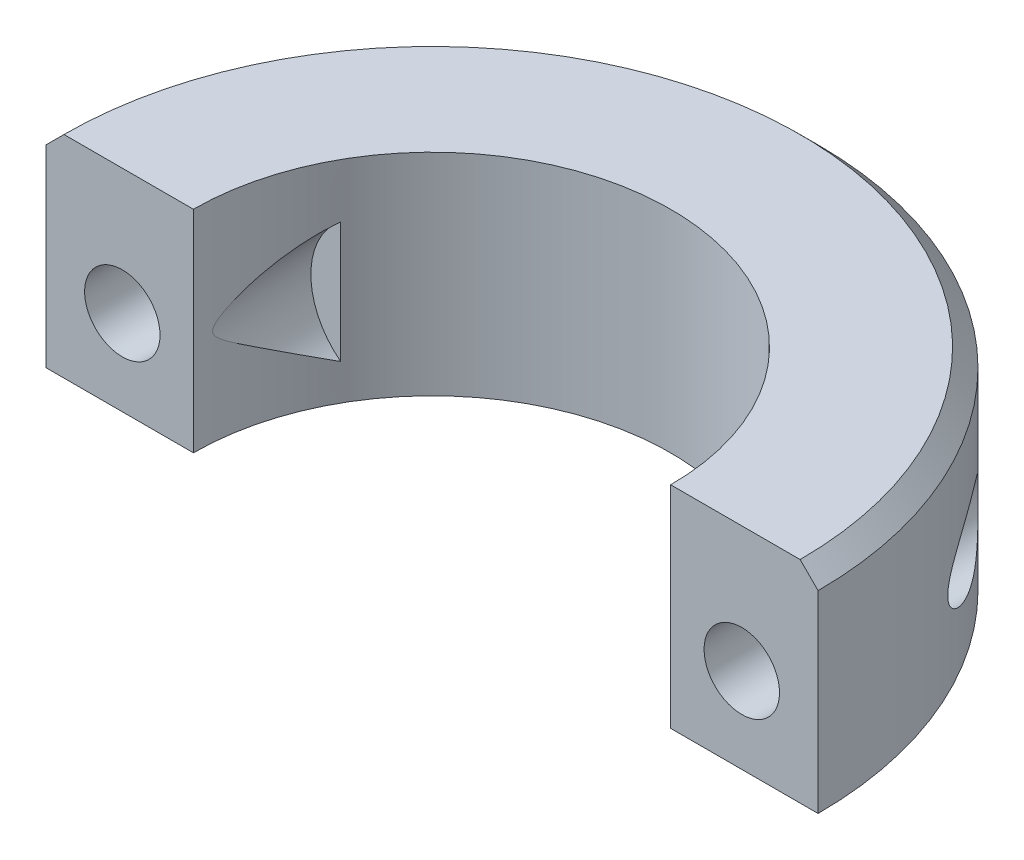
ISO-10303-21;
HEADER;
FILE_DESCRIPTION(('STEP AP214'),'2;1');
FILE_NAME('part.step','',(''),(''),'','','');
FILE_SCHEMA(('AUTOMOTIVE_DESIGN { 1 0 10303 214 1 1 1 1 }'));
ENDSEC;
DATA;
#1=APPLICATION_CONTEXT('core data for automotive mechanical design processes');
#2=APPLICATION_PROTOCOL_DEFINITION('international standard','automotive_design',2000,#1);
#3=PRODUCT_CONTEXT('',#1,'mechanical');
#4=PRODUCT('Part','Part','',(#3));
#5=PRODUCT_RELATED_PRODUCT_CATEGORY('part','',(#4));
#6=PRODUCT_DEFINITION_FORMATION('','',#4);
#7=PRODUCT_DEFINITION_CONTEXT('part definition',#1,'design');
#8=PRODUCT_DEFINITION('design','',#6,#7);
#9=PRODUCT_DEFINITION_SHAPE('','',#8);
#10=(LENGTH_UNIT() NAMED_UNIT(*) SI_UNIT(.MILLI.,.METRE.));
#11=(NAMED_UNIT(*) PLANE_ANGLE_UNIT() SI_UNIT($,.RADIAN.));
#12=(NAMED_UNIT(*) SI_UNIT($,.STERADIAN.) SOLID_ANGLE_UNIT());
#13=UNCERTAINTY_MEASURE_WITH_UNIT(LENGTH_MEASURE(1.E-05),#10,'distance_accuracy_value','');
#14=(GEOMETRIC_REPRESENTATION_CONTEXT(3) GLOBAL_UNCERTAINTY_ASSIGNED_CONTEXT((#13)) GLOBAL_UNIT_ASSIGNED_CONTEXT((#10,
#11,#12)) REPRESENTATION_CONTEXT('',''));
#15=CARTESIAN_POINT('',(0.,0.,0.));
#16=DIRECTION('',(0.,0.,1.));
#17=DIRECTION('',(1.,0.,0.));
#18=AXIS2_PLACEMENT_3D('',#15,#16,#17);
#19=CARTESIAN_POINT('',(0.,5.875,0.));
#20=DIRECTION('',(0.,-1.,0.));
#21=DIRECTION('',(0.,0.,-1.));
#22=AXIS2_PLACEMENT_3D('',#19,#20,#21);
#23=CYLINDRICAL_SURFACE('',#22,13.29);
#24=DIRECTION('',(0.,-1.,0.));
#25=VECTOR('',#24,1.);
#26=CARTESIAN_POINT('',(11.5919842995063,5.875,-6.5));
#27=LINE('',#26,#25);
#28=CARTESIAN_POINT('',(11.5919842995063,-3.86810293653756,-6.5));
#29=VERTEX_POINT('',#28);
#30=CARTESIAN_POINT('',(11.5919842995063,2.86810293653756,-6.5));
#31=VERTEX_POINT('',#30);
#32=EDGE_CURVE('E45',#29,#31,#27,.F.);
#33=ORIENTED_EDGE('',*,*,#32,.T.);
#34=CARTESIAN_POINT('',(11.5919842995063,2.86810293653756,-6.5));
#35=CARTESIAN_POINT('',(11.674683553741,2.80444816907887,-6.35251308565447));
#36=CARTESIAN_POINT('',(11.7541320407431,2.73846936503557,-6.20423050295897));
#37=CARTESIAN_POINT('',(11.9066140690534,2.60234710274309,-5.90632247899956));
#38=CARTESIAN_POINT('',(11.9796488049704,2.53220442414301,-5.75669729355206));
#39=CARTESIAN_POINT('',(12.1194056480824,2.38822924076577,-5.45632970509054));
#40=CARTESIAN_POINT('',(12.1861291129961,2.31439753484135,-5.30558754992459));
#41=CARTESIAN_POINT('',(12.3133814671471,2.1634087979424,-5.00316510668472));
#42=CARTESIAN_POINT('',(12.3739100706451,2.08625161381254,-4.85148477567911));
#43=CARTESIAN_POINT('',(12.545732212589,1.85114484089873,-4.3969544518868));
#44=CARTESIAN_POINT('',(12.6480399030139,1.68874820151547,-4.09293363102073));
#45=CARTESIAN_POINT('',(12.7838946017017,1.43744373143042,-3.636122948353));
#46=CARTESIAN_POINT('',(12.8262430339326,1.35239594178326,-3.48373189564499));
#47=CARTESIAN_POINT('',(12.9051597349178,1.17965887621674,-3.17894861259805));
#48=CARTESIAN_POINT('',(12.9417284761305,1.09196981690528,-3.02655638337478));
#49=CARTESIAN_POINT('',(13.004945002859,0.924737422607228,-2.74119100588829));
#50=CARTESIAN_POINT('',(13.0322611288032,0.845539249316874,-2.60816243779073));
#51=CARTESIAN_POINT('',(13.0825487556787,0.684255321600288,-2.34290862496351));
#52=CARTESIAN_POINT('',(13.1055176995737,0.602167901158613,-2.2106838970367));
#53=CARTESIAN_POINT('',(13.1387635241688,0.467384927982262,-2.00083742009191));
#54=CARTESIAN_POINT('',(13.1504406107536,0.416076749781199,-1.92254473359381));
#55=CARTESIAN_POINT('',(13.1721927251551,0.311283756543663,-1.76735693629119));
#56=CARTESIAN_POINT('',(13.1822702040014,0.257802432435854,-1.69045985037237));
#57=CARTESIAN_POINT('',(13.1974967413069,0.166946671341005,-1.56607613963459));
#58=CARTESIAN_POINT('',(13.2031219858929,0.130627447384498,-1.51787800507553));
#59=CARTESIAN_POINT('',(13.2136689819392,0.0558083074120869,-1.4231345719551));
#60=CARTESIAN_POINT('',(13.2185912504232,0.0173100234510277,-1.37658807778244));
#61=CARTESIAN_POINT('',(13.2277327354438,-0.0635743347727764,-1.28580710648521));
#62=CARTESIAN_POINT('',(13.2319414946754,-0.106006112688138,-1.24161261951803));
#63=CARTESIAN_POINT('',(13.2393989391951,-0.196576463985613,-1.15933232349147));
#64=CARTESIAN_POINT('',(13.242654692794,-0.244669109606696,-1.12120255107956));
#65=CARTESIAN_POINT('',(13.2461328598021,-0.317636989196302,-1.07898889979125));
#66=CARTESIAN_POINT('',(13.246988830886,-0.33858116415416,-1.06839556318918));
#67=CARTESIAN_POINT('',(13.248412627088,-0.381858326462471,-1.05059042804323));
#68=CARTESIAN_POINT('',(13.2489813030533,-0.40418699037042,-1.04336864924413));
#69=CARTESIAN_POINT('',(13.2496933027825,-0.445653565010836,-1.03428494252242));
#70=CARTESIAN_POINT('',(13.2498955641673,-0.464624334322012,-1.0316822291538));
#71=CARTESIAN_POINT('',(13.2500417813202,-0.502739445008462,-1.02980284791419));
#72=CARTESIAN_POINT('',(13.2499857418643,-0.521883783167849,-1.03052611854449));
#73=CARTESIAN_POINT('',(13.2496228087371,-0.559691239848819,-1.03518118656552));
#74=CARTESIAN_POINT('',(13.2493167981292,-0.578355814178027,-1.03910168913748));
#75=CARTESIAN_POINT('',(13.2484862009074,-0.614890637455083,-1.04963865509748));
#76=CARTESIAN_POINT('',(13.2479614363715,-0.632760226683787,-1.05625731291495));
#77=CARTESIAN_POINT('',(13.246240573559,-0.681449502851134,-1.07768108402632));
#78=CARTESIAN_POINT('',(13.2448429144774,-0.711224750963397,-1.09480432452652));
#79=CARTESIAN_POINT('',(13.2416303082759,-0.768120917074016,-1.13300542711849));
#80=CARTESIAN_POINT('',(13.2398133977205,-0.79522846172385,-1.15410180794257));
#81=CARTESIAN_POINT('',(13.2343180640448,-0.867736576868285,-1.21592965271397));
#82=CARTESIAN_POINT('',(13.2302918883958,-0.910942634383516,-1.25915756571621));
#83=CARTESIAN_POINT('',(13.2214366143842,-0.993648554419927,-1.34899492441776));
#84=CARTESIAN_POINT('',(13.2166051629658,-1.03313700863596,-1.39561404756265));
#85=CARTESIAN_POINT('',(13.2061868729586,-1.1099178230725,-1.49098621421026));
#86=CARTESIAN_POINT('',(13.2005958650401,-1.14719630469799,-1.53974995350306));
#87=CARTESIAN_POINT('',(13.1887236459745,-1.22003380032069,-1.63833370320863));
#88=CARTESIAN_POINT('',(13.1824434604563,-1.25559525898485,-1.68815205731413));
#89=CARTESIAN_POINT('',(13.1627099222086,-1.35984664878392,-1.83771443424663));
#90=CARTESIAN_POINT('',(13.1482610401625,-1.42683014582892,-1.93851512702319));
#91=CARTESIAN_POINT('',(13.1167355552524,-1.55807067326738,-2.14147921886226));
#92=CARTESIAN_POINT('',(13.0996582448233,-1.62232696354524,-2.24364297807448));
#93=CARTESIAN_POINT('',(13.0444528520081,-1.81239717399877,-2.5514261206095));
#94=CARTESIAN_POINT('',(13.0023806708967,-1.93536251750535,-2.75811148365541));
#95=CARTESIAN_POINT('',(12.9078641895137,-2.17559027998311,-3.17110527228139));
#96=CARTESIAN_POINT('',(12.8554670634288,-2.29287572129281,-3.3774112570923));
#97=CARTESIAN_POINT('',(12.7400489042111,-2.52263698117548,-3.78959386189149));
#98=CARTESIAN_POINT('',(12.6770333799872,-2.63511525600333,-3.99547064876546));
#99=CARTESIAN_POINT('',(12.5439344750876,-2.84904299745742,-4.39495969457987));
#100=CARTESIAN_POINT('',(12.4744316861671,-2.95075868211778,-4.58862280617681));
#101=CARTESIAN_POINT('',(12.3255524311062,-3.14926249475697,-4.97470233641184));
#102=CARTESIAN_POINT('',(12.2461753118014,-3.24605029617012,-5.16711867169186));
#103=CARTESIAN_POINT('',(12.0770844342733,-3.4343006092473,-5.55087721251516));
#104=CARTESIAN_POINT('',(11.9873395110739,-3.52574575205628,-5.74221426577177));
#105=CARTESIAN_POINT('',(11.7974857437894,-3.70207864758323,-6.12279679997598));
#106=CARTESIAN_POINT('',(11.6973751043121,-3.78696525987107,-6.31204191228583));
#107=CARTESIAN_POINT('',(11.5919842995063,-3.86810293653756,-6.5));
#108=B_SPLINE_CURVE_WITH_KNOTS('',3,(#34,#35,#36,#37,#38,#39,#40,#41,#42,#43,#44,#45,#46,#47,
#48,#49,#50,#51,#52,#53,#54,#55,#56,#57,#58,#59,#60,#61,#62,#63,#64,#65,#66,#67,#68,#69,#70,#71,
#72,#73,#74,#75,#76,#77,#78,#79,#80,#81,#82,#83,#84,#85,#86,#87,#88,#89,#90,#91,#92,#93,#94,#95,
#96,#97,#98,#99,#100,#101,#102,#103,#104,#105,#106,#107),.UNSPECIFIED.,.F.,.F.,(4,2,2,2,2,2,2,2,
2,2,2,2,2,2,2,2,2,2,2,2,2,2,2,2,2,2,2,2,2,2,2,2,2,2,2,2,4),(0.,0.541949872363878,
1.08379858748111,1.62553047043984,2.1672873296443,3.24474798987891,3.78341427216842,
4.32203649860301,4.79359624328967,5.26543250577502,5.54840253814195,5.83093470920882,
6.01274087141602,6.19441262282982,6.37855193528524,6.56128873790214,6.63154115710311,
6.70158428030512,6.75876346401919,6.81594159047254,6.87291859505446,6.92994203219778,
7.03246720871821,7.1354826416464,7.31872476153905,7.50251202555583,7.68735228345345,
7.8719211011953,8.2374637654606,8.60310500537523,9.33520442692762,10.0640333956324,
10.7924853997919,11.4808081675069,12.1691764904393,12.8596706593872,13.5502846259549),.UNSPECIFIED.);
#109=EDGE_CURVE('E11',#31,#29,#108,.T.);
#110=ORIENTED_EDGE('',*,*,#109,.T.);
#111=EDGE_LOOP('',(#33,#110));
#112=FACE_BOUND('',#111,.T.);
#113=DIRECTION('',(0.,-1.,0.));
#114=VECTOR('',#113,1.);
#115=CARTESIAN_POINT('',(-11.5919842995063,5.875,-6.5));
#116=LINE('',#115,#114);
#117=CARTESIAN_POINT('',(-11.5919842995063,-3.86810293653756,-6.5));
#118=VERTEX_POINT('',#117);
#119=CARTESIAN_POINT('',(-11.5919842995063,2.86810293653756,-6.5));
#120=VERTEX_POINT('',#119);
#121=EDGE_CURVE('E106',#118,#120,#116,.F.);
#122=ORIENTED_EDGE('',*,*,#121,.F.);
#123=CARTESIAN_POINT('',(-11.5919842995063,-3.86810293653756,-6.5));
#124=CARTESIAN_POINT('',(-11.674683553741,-3.80444816907887,-6.35251308565447));
#125=CARTESIAN_POINT('',(-11.7541320407431,-3.73846936503557,-6.20423050295896));
#126=CARTESIAN_POINT('',(-11.9066140690534,-3.60234710274309,-5.90632247899956));
#127=CARTESIAN_POINT('',(-11.9796488049704,-3.532204424143,-5.75669729355205));
#128=CARTESIAN_POINT('',(-12.1194056480824,-3.38822924076576,-5.45632970509053));
#129=CARTESIAN_POINT('',(-12.1861291129961,-3.31439753484135,-5.30558754992459));
#130=CARTESIAN_POINT('',(-12.3133814671471,-3.16340879794239,-5.00316510668471));
#131=CARTESIAN_POINT('',(-12.3739100706451,-3.08625161381253,-4.8514847756791));
#132=CARTESIAN_POINT('',(-12.545732212589,-2.85114484089872,-4.39695445188678));
#133=CARTESIAN_POINT('',(-12.6480399030139,-2.68874820151547,-4.09293363102072));
#134=CARTESIAN_POINT('',(-12.7838946017017,-2.43744373143042,-3.63612294835299));
#135=CARTESIAN_POINT('',(-12.8262430339326,-2.35239594178326,-3.48373189564499));
#136=CARTESIAN_POINT('',(-12.9051597349178,-2.17965887621673,-3.17894861259805));
#137=CARTESIAN_POINT('',(-12.9417284761305,-2.09196981690528,-3.02655638337478));
#138=CARTESIAN_POINT('',(-13.004945002859,-1.92473742260723,-2.7411910058883));
#139=CARTESIAN_POINT('',(-13.0322611288032,-1.84553924931687,-2.60816243779074));
#140=CARTESIAN_POINT('',(-13.0825487556787,-1.6842553216003,-2.34290862496352));
#141=CARTESIAN_POINT('',(-13.1055176995737,-1.60216790115863,-2.21068389703671));
#142=CARTESIAN_POINT('',(-13.1387635241688,-1.46738492798227,-2.00083742009193));
#143=CARTESIAN_POINT('',(-13.1504406107536,-1.4160767497812,-1.92254473359383));
#144=CARTESIAN_POINT('',(-13.1721927251551,-1.31128375654366,-1.7673569362912));
#145=CARTESIAN_POINT('',(-13.1822702040014,-1.25780243243585,-1.69045985037237));
#146=CARTESIAN_POINT('',(-13.1974967413069,-1.16694667134101,-1.56607613963459));
#147=CARTESIAN_POINT('',(-13.2031219858929,-1.13062744738451,-1.51787800507553));
#148=CARTESIAN_POINT('',(-13.2136689819392,-1.05580830741209,-1.4231345719551));
#149=CARTESIAN_POINT('',(-13.2185912504232,-1.01731002345103,-1.37658807778245));
#150=CARTESIAN_POINT('',(-13.2277327354438,-0.93642566522722,-1.28580710648522));
#151=CARTESIAN_POINT('',(-13.2319414946754,-0.893993887311857,-1.24161261951804));
#152=CARTESIAN_POINT('',(-13.2393989391951,-0.803423536014388,-1.15933232349146));
#153=CARTESIAN_POINT('',(-13.2426546927939,-0.755330890393312,-1.12120255107955));
#154=CARTESIAN_POINT('',(-13.2461328598021,-0.682363010803703,-1.07898889979125));
#155=CARTESIAN_POINT('',(-13.246988830886,-0.661418835845841,-1.06839556318918));
#156=CARTESIAN_POINT('',(-13.248412627088,-0.618141673537526,-1.05059042804324));
#157=CARTESIAN_POINT('',(-13.2489813030533,-0.595813009629575,-1.04336864924415));
#158=CARTESIAN_POINT('',(-13.2496933027825,-0.554346434989157,-1.03428494252244));
#159=CARTESIAN_POINT('',(-13.2498955641673,-0.535375665677981,-1.03168222915381));
#160=CARTESIAN_POINT('',(-13.2500417813202,-0.497260554991531,-1.02980284791419));
#161=CARTESIAN_POINT('',(-13.2499857418643,-0.478116216832144,-1.03052611854449));
#162=CARTESIAN_POINT('',(-13.2496228087371,-0.440308760151174,-1.03518118656551));
#163=CARTESIAN_POINT('',(-13.2493167981292,-0.421644185821965,-1.03910168913747));
#164=CARTESIAN_POINT('',(-13.2484862009074,-0.385109362544909,-1.04963865509748));
#165=CARTESIAN_POINT('',(-13.2479614363715,-0.367239773316205,-1.05625731291495));
#166=CARTESIAN_POINT('',(-13.246240573559,-0.318550497148854,-1.07768108402633));
#167=CARTESIAN_POINT('',(-13.2448429144774,-0.288775249036584,-1.09480432452653));
#168=CARTESIAN_POINT('',(-13.2416303082759,-0.231879082925956,-1.1330054271185));
#169=CARTESIAN_POINT('',(-13.2398133977205,-0.204771538276121,-1.15410180794258));
#170=CARTESIAN_POINT('',(-13.2343180640448,-0.13226342313168,-1.215929652714));
#171=CARTESIAN_POINT('',(-13.2302918883958,-0.0890573656164464,-1.25915756571625));
#172=CARTESIAN_POINT('',(-13.2214366143842,-0.00635144558002452,-1.34899492441782));
#173=CARTESIAN_POINT('',(-13.2166051629658,0.0331370086360211,-1.39561404756271));
#174=CARTESIAN_POINT('',(-13.2061868729586,0.109917823072572,-1.49098621421034));
#175=CARTESIAN_POINT('',(-13.2005958650401,0.147196304698066,-1.53974995350315));
#176=CARTESIAN_POINT('',(-13.1887236459745,0.220033800320778,-1.63833370320875));
#177=CARTESIAN_POINT('',(-13.1824434604563,0.255595258984936,-1.68815205731425));
#178=CARTESIAN_POINT('',(-13.1627099222085,0.359846648784024,-1.83771443424679));
#179=CARTESIAN_POINT('',(-13.1482610401625,0.426830145829034,-1.93851512702337));
#180=CARTESIAN_POINT('',(-13.1167355552524,0.558070673267523,-2.14147921886247));
#181=CARTESIAN_POINT('',(-13.0996582448233,0.622326963545393,-2.24364297807472));
#182=CARTESIAN_POINT('',(-13.044452852008,0.812397173998953,-2.5514261206098));
#183=CARTESIAN_POINT('',(-13.0023806708967,0.93536251750556,-2.75811148365575));
#184=CARTESIAN_POINT('',(-12.9078641895136,1.17559027998336,-3.17110527228181));
#185=CARTESIAN_POINT('',(-12.8554670634286,1.29287572129307,-3.37741125709276));
#186=CARTESIAN_POINT('',(-12.740048904211,1.52263698117577,-3.78959386189202));
#187=CARTESIAN_POINT('',(-12.6770333799871,1.63511525600364,-3.99547064876603));
#188=CARTESIAN_POINT('',(-12.5439344750874,1.84904299745771,-4.39495969458041));
#189=CARTESIAN_POINT('',(-12.4744316861669,1.95075868211804,-4.5886228061773));
#190=CARTESIAN_POINT('',(-12.325552431106,2.14926249475717,-4.97470233641223));
#191=CARTESIAN_POINT('',(-12.2461753118013,2.24605029617029,-5.1671186716922));
#192=CARTESIAN_POINT('',(-12.0770844342732,2.43430060924741,-5.5508772125154));
#193=CARTESIAN_POINT('',(-11.9873395110739,2.52574575205637,-5.74221426577197));
#194=CARTESIAN_POINT('',(-11.7974857437893,2.70207864758328,-6.12279679997607));
#195=CARTESIAN_POINT('',(-11.6973751043121,2.78696525987109,-6.31204191228588));
#196=CARTESIAN_POINT('',(-11.5919842995063,2.86810293653756,-6.5));
#197=B_SPLINE_CURVE_WITH_KNOTS('',3,(#123,#124,#125,#126,#127,#128,#129,#130,#131,#132,#133,
#134,#135,#136,#137,#138,#139,#140,#141,#142,#143,#144,#145,#146,#147,#148,#149,#150,#151,#152,
#153,#154,#155,#156,#157,#158,#159,#160,#161,#162,#163,#164,#165,#166,#167,#168,#169,#170,#171,
#172,#173,#174,#175,#176,#177,#178,#179,#180,#181,#182,#183,#184,#185,#186,#187,#188,#189,#190,
#191,#192,#193,#194,#195,#196),.UNSPECIFIED.,.F.,.F.,(4,2,2,2,2,2,2,2,2,2,2,2,2,2,2,2,2,2,2,2,2,
2,2,2,2,2,2,2,2,2,2,2,2,2,2,2,4),(0.,0.541949872363883,1.08379858748112,1.62553047043986,
2.16728732964432,3.24474798987892,3.78341427216842,4.32203649860301,4.79359624328966,
5.265432505775,5.54840253814193,5.83093470920881,6.01274087141601,6.19441262282982,
6.37855193528524,6.56128873790213,6.63154115710311,6.70158428030512,6.75876346401919,
6.81594159047254,6.87291859505447,6.92994203219778,7.03246720871823,7.13548264164644,
7.31872476153911,7.50251202555592,7.68735228345358,7.87192110119547,8.23746376546084,
8.60310500537554,9.33520442692807,10.064033395633,10.7924853997926,11.4808081675074,
12.1691764904396,12.8596706593874,13.5502846259549),.UNSPECIFIED.);
#198=EDGE_CURVE('E96',#118,#120,#197,.T.);
#199=ORIENTED_EDGE('',*,*,#198,.T.);
#200=EDGE_LOOP('',(#122,#199));
#201=FACE_BOUND('',#200,.T.);
#202=CARTESIAN_POINT('',(0.,-5.875,0.));
#203=DIRECTION('',(0.,-1.,0.));
#204=DIRECTION('',(0.,0.,1.));
#205=AXIS2_PLACEMENT_3D('',#202,#203,#204);
#206=CIRCLE('',#205,13.29);
#207=CARTESIAN_POINT('',(-13.29,-5.875,0.));
#208=VERTEX_POINT('',#207);
#209=CARTESIAN_POINT('',(13.29,-5.875,0.));
#210=VERTEX_POINT('',#209);
#211=EDGE_CURVE('E111',#208,#210,#206,.T.);
#212=ORIENTED_EDGE('',*,*,#211,.T.);
#213=DIRECTION('',(0.,-1.,0.));
#214=VECTOR('',#213,1.);
#215=CARTESIAN_POINT('',(13.29,5.875,0.));
#216=LINE('',#215,#214);
#217=CARTESIAN_POINT('',(13.29,5.875,0.));
#218=VERTEX_POINT('',#217);
#219=EDGE_CURVE('E114',#218,#210,#216,.T.);
#220=ORIENTED_EDGE('',*,*,#219,.F.);
#221=CARTESIAN_POINT('',(0.,5.875,0.));
#222=DIRECTION('',(0.,-1.,0.));
#223=DIRECTION('',(0.,0.,1.));
#224=AXIS2_PLACEMENT_3D('',#221,#222,#223);
#225=CIRCLE('',#224,13.29);
#226=CARTESIAN_POINT('',(-13.29,5.875,0.));
#227=VERTEX_POINT('',#226);
#228=EDGE_CURVE('E136',#227,#218,#225,.T.);
#229=ORIENTED_EDGE('',*,*,#228,.F.);
#230=DIRECTION('',(0.,-1.,0.));
#231=VECTOR('',#230,1.);
#232=CARTESIAN_POINT('',(-13.29,5.875,0.));
#233=LINE('',#232,#231);
#234=EDGE_CURVE('E116',#227,#208,#233,.T.);
#235=ORIENTED_EDGE('',*,*,#234,.T.);
#236=EDGE_LOOP('',(#212,#220,#229,#235));
#237=FACE_BOUND('',#236,.T.);
#238=ADVANCED_FACE('F33',(#112,#201,#237),#23,.F.);
#239=CARTESIAN_POINT('',(13.29,5.875,0.));
#240=DIRECTION('',(0.,0.,-1.));
#241=DIRECTION('',(-1.,0.,0.));
#242=AXIS2_PLACEMENT_3D('',#239,#240,#241);
#243=PLANE('',#242);
#244=CARTESIAN_POINT('',(17.25,-1.125,0.));
#245=DIRECTION('',(0.,0.,1.));
#246=DIRECTION('',(-1.,0.,0.));
#247=AXIS2_PLACEMENT_3D('',#244,#245,#246);
#248=CIRCLE('',#247,2.1);
#249=CARTESIAN_POINT('',(15.15,-1.125,0.));
#250=VERTEX_POINT('',#249);
#251=EDGE_CURVE('E159',#250,#250,#248,.T.);
#252=ORIENTED_EDGE('',*,*,#251,.F.);
#253=EDGE_LOOP('',(#252));
#254=FACE_BOUND('',#253,.T.);
#255=DIRECTION('',(0.,-1.,0.));
#256=VECTOR('',#255,1.);
#257=CARTESIAN_POINT('',(21.5,5.875,0.));
#258=LINE('',#257,#256);
#259=CARTESIAN_POINT('',(21.5,4.875,0.));
#260=VERTEX_POINT('',#259);
#261=CARTESIAN_POINT('',(21.5,-5.875,0.));
#262=VERTEX_POINT('',#261);
#263=EDGE_CURVE('E140',#260,#262,#258,.T.);
#264=ORIENTED_EDGE('',*,*,#263,.F.);
#265=DIRECTION('',(0.707106781186546,-0.707106781186549,0.));
#266=VECTOR('',#265,1.);
#267=CARTESIAN_POINT('',(0.,26.3750000000001,0.));
#268=LINE('',#267,#266);
#269=CARTESIAN_POINT('',(20.5,5.875,0.));
#270=VERTEX_POINT('',#269);
#271=EDGE_CURVE('E150',#260,#270,#268,.F.);
#272=ORIENTED_EDGE('',*,*,#271,.T.);
#273=DIRECTION('',(1.,0.,0.));
#274=VECTOR('',#273,1.);
#275=CARTESIAN_POINT('',(13.29,5.875,0.));
#276=LINE('',#275,#274);
#277=EDGE_CURVE('E187',#218,#270,#276,.T.);
#278=ORIENTED_EDGE('',*,*,#277,.F.);
#279=ORIENTED_EDGE('',*,*,#219,.T.);
#280=DIRECTION('',(1.,0.,0.));
#281=VECTOR('',#280,1.);
#282=CARTESIAN_POINT('',(13.29,-5.875,0.));
#283=LINE('',#282,#281);
#284=EDGE_CURVE('E119',#210,#262,#283,.T.);
#285=ORIENTED_EDGE('',*,*,#284,.T.);
#286=EDGE_LOOP('',(#264,#272,#278,#279,#285));
#287=FACE_BOUND('',#286,.T.);
#288=ADVANCED_FACE('F102',(#254,#287),#243,.F.);
#289=CARTESIAN_POINT('',(0.,5.875,0.));
#290=DIRECTION('',(0.,-1.,0.));
#291=DIRECTION('',(0.,0.,-1.));
#292=AXIS2_PLACEMENT_3D('',#289,#290,#291);
#293=CYLINDRICAL_SURFACE('',#292,21.5);
#294=CARTESIAN_POINT('',(19.35,-1.125,-9.37163272861244));
#295=CARTESIAN_POINT('',(19.3499962960774,-1.06831417827864,-9.37164093917198));
#296=CARTESIAN_POINT('',(19.3476758083045,-1.01154698406013,-9.37643623240864));
#297=CARTESIAN_POINT('',(19.3386510552647,-0.899827118186366,-9.39503450806355));
#298=CARTESIAN_POINT('',(19.331935804325,-0.844879357186285,-9.4088600634285));
#299=CARTESIAN_POINT('',(19.3124993329772,-0.72404801023417,-9.44870224859078));
#300=CARTESIAN_POINT('',(19.2986617027533,-0.659098652142412,-9.47697146968819));
#301=CARTESIAN_POINT('',(19.266451615933,-0.535034969786687,-9.54228284549294));
#302=CARTESIAN_POINT('',(19.2480700866745,-0.475932654807306,-9.57934254581355));
#303=CARTESIAN_POINT('',(19.2111275318155,-0.372337867121576,-9.65318634489908));
#304=CARTESIAN_POINT('',(19.1930590866954,-0.327016135260551,-9.68907862432));
#305=CARTESIAN_POINT('',(19.1549970817993,-0.239991374277043,-9.76411103990107));
#306=CARTESIAN_POINT('',(19.1350021280205,-0.198291007656361,-9.80325352500515));
#307=CARTESIAN_POINT('',(19.0725982074441,-0.077935637448556,-9.92442491111453));
#308=CARTESIAN_POINT('',(19.0278242821209,-0.00416922537638675,-10.0100887925308));
#309=CARTESIAN_POINT('',(18.9341309624176,0.132165596072495,-10.1861968495521));
#310=CARTESIAN_POINT('',(18.8852501416074,0.194824065833028,-10.2765940735692));
#311=CARTESIAN_POINT('',(18.7837756819797,0.311491467929439,-10.4609200858057));
#312=CARTESIAN_POINT('',(18.7311786802382,0.365492417466729,-10.5548520358733));
#313=CARTESIAN_POINT('',(18.6226998733327,0.465964577163585,-10.7450953136763));
#314=CARTESIAN_POINT('',(18.5668115037455,0.512419994012186,-10.8414111579082));
#315=CARTESIAN_POINT('',(18.4521498442615,0.598358744680794,-11.0354373519405));
#316=CARTESIAN_POINT('',(18.3933758595347,0.637840388652928,-11.1331480335481));
#317=CARTESIAN_POINT('',(18.2453283795406,0.726991215501926,-11.3748099095545));
#318=CARTESIAN_POINT('',(18.1545332903444,0.772913192507887,-11.5192236562327));
#319=CARTESIAN_POINT('',(17.9677463751609,0.851129746020062,-11.8084618656856));
#320=CARTESIAN_POINT('',(17.871751766608,0.883416942818309,-11.9532865082761));
#321=CARTESIAN_POINT('',(17.6752125116676,0.933998185765876,-12.2420297891493));
#322=CARTESIAN_POINT('',(17.574674314731,0.95231144512711,-12.3859494006076));
#323=CARTESIAN_POINT('',(17.3696185378974,0.974122903140448,-12.6719115810379));
#324=CARTESIAN_POINT('',(17.2651033932873,0.977630025593265,-12.8139552291879));
#325=CARTESIAN_POINT('',(17.020140521126,0.967003870640702,-13.1384022653087));
#326=CARTESIAN_POINT('',(16.8785036704095,0.947130248937676,-13.3198223426));
#327=CARTESIAN_POINT('',(16.6643701215671,0.893026547950736,-13.5853515968194));
#328=CARTESIAN_POINT('',(16.5927414313383,0.870956727429114,-13.6727277057636));
#329=CARTESIAN_POINT('',(16.4494932794036,0.817941641455709,-13.8447344834726));
#330=CARTESIAN_POINT('',(16.3778738233101,0.786999499833113,-13.9293661068818));
#331=CARTESIAN_POINT('',(16.2068921365225,0.701035509872691,-14.1283405955098));
#332=CARTESIAN_POINT('',(16.1078871947488,0.641332414738293,-14.2410329586485));
#333=CARTESIAN_POINT('',(15.9146932682453,0.500185316634399,-14.4566035424263));
#334=CARTESIAN_POINT('',(15.820497759869,0.418771749016977,-14.5594952304166));
#335=CARTESIAN_POINT('',(15.6657610437447,0.256728474502908,-14.7255977714398));
#336=CARTESIAN_POINT('',(15.6029367446255,0.181661228241371,-14.7920798110822));
#337=CARTESIAN_POINT('',(15.4854726505266,0.0180427608819447,-14.915003542236));
#338=CARTESIAN_POINT('',(15.430821629943,-0.0704896228363732,-14.9714590251157));
#339=CARTESIAN_POINT('',(15.3427295316144,-0.241983543433047,-15.0616680120899));
#340=CARTESIAN_POINT('',(15.3072305836302,-0.322678354548943,-15.0977013529767));
#341=CARTESIAN_POINT('',(15.2458747842731,-0.491347139454314,-15.1596572953431));
#342=CARTESIAN_POINT('',(15.220012815911,-0.579317219853116,-15.1855852628538));
#343=CARTESIAN_POINT('',(15.17967020102,-0.761066987724553,-15.2259137587957));
#344=CARTESIAN_POINT('',(15.1652650433494,-0.85488088707282,-15.2402378405802));
#345=CARTESIAN_POINT('',(15.1493819675563,-1.04466173916161,-15.2560271207641));
#346=CARTESIAN_POINT('',(15.1478978478189,-1.14062763684628,-15.2574984879869));
#347=CARTESIAN_POINT('',(15.1574146097696,-1.3207940367221,-15.2480426736212));
#348=CARTESIAN_POINT('',(15.1670794594691,-1.40514218259353,-15.2384423017392));
#349=CARTESIAN_POINT('',(15.1960662013634,-1.57041703409652,-15.2095360482972));
#350=CARTESIAN_POINT('',(15.2153884290563,-1.65134362075692,-15.1902298295552));
#351=CARTESIAN_POINT('',(15.2629940806962,-1.80968743448338,-15.1423961620016));
#352=CARTESIAN_POINT('',(15.2914641516096,-1.88698928536309,-15.1136763746031));
#353=CARTESIAN_POINT('',(15.3556685719218,-2.03495980550004,-15.0484398613867));
#354=CARTESIAN_POINT('',(15.3914065243604,-2.10562515922609,-15.011919267879));
#355=CARTESIAN_POINT('',(15.4871263108482,-2.27189549803355,-14.9132687294093));
#356=CARTESIAN_POINT('',(15.5505223275958,-2.36323780872635,-14.8472501803756));
#357=CARTESIAN_POINT('',(15.6855848865285,-2.5300563670257,-14.7044943771367));
#358=CARTESIAN_POINT('',(15.7572696559524,-2.6054965768828,-14.6277334190236));
#359=CARTESIAN_POINT('',(15.9375328578128,-2.77064245657177,-14.4315442943541));
#360=CARTESIAN_POINT('',(16.0487198341305,-2.8525308906438,-14.307963477452));
#361=CARTESIAN_POINT('',(16.2749401994869,-2.98961950840966,-14.0501218355563));
#362=CARTESIAN_POINT('',(16.389979869659,-3.04477359090544,-13.9158430236047));
#363=CARTESIAN_POINT('',(16.5911163147257,-3.12107915713244,-13.6749033482348));
#364=CARTESIAN_POINT('',(16.6772200156062,-3.14729274088386,-13.5697840634291));
#365=CARTESIAN_POINT('',(16.8485039832601,-3.18814313291931,-13.3565196254402));
#366=CARTESIAN_POINT('',(16.9336837632937,-3.20277410608273,-13.2483729754897));
#367=CARTESIAN_POINT('',(17.1024792839168,-3.22153485401428,-13.0297472978619));
#368=CARTESIAN_POINT('',(17.1860924904906,-3.22564886549754,-12.9192650190294));
#369=CARTESIAN_POINT('',(17.3511115078037,-3.22418635303443,-12.696775658247));
#370=CARTESIAN_POINT('',(17.4325176698307,-3.21861138055618,-12.584768823269));
#371=CARTESIAN_POINT('',(17.5962632702158,-3.19797033511236,-12.3548490982136));
#372=CARTESIAN_POINT('',(17.6784886986867,-3.18250111972037,-12.2368915938885));
#373=CARTESIAN_POINT('',(17.8398388889081,-3.14217787682177,-12.0004433541213));
#374=CARTESIAN_POINT('',(17.9189631510213,-3.11732234386512,-11.8819525361561));
#375=CARTESIAN_POINT('',(18.0737050556779,-3.05848224036195,-11.6452197426732));
#376=CARTESIAN_POINT('',(18.1493280497054,-3.02451217992258,-11.5269776701154));
#377=CARTESIAN_POINT('',(18.2968946477529,-2.94734450973933,-11.2912792983878));
#378=CARTESIAN_POINT('',(18.3688394330632,-2.90414988591532,-11.1738227576053));
#379=CARTESIAN_POINT('',(18.5241958671881,-2.79747930208071,-10.914744780062));
#380=CARTESIAN_POINT('',(18.6066453256521,-2.73163189359833,-10.773495742139));
#381=CARTESIAN_POINT('',(18.7251944904914,-2.62056722774692,-10.5652026751672));
#382=CARTESIAN_POINT('',(18.7638741398371,-2.58147490404276,-10.4963360246939));
#383=CARTESIAN_POINT('',(18.8393138031198,-2.49875911333458,-10.3603237396508));
#384=CARTESIAN_POINT('',(18.8760742439357,-2.45513666045011,-10.2931777240759));
#385=CARTESIAN_POINT('',(18.965204846037,-2.33980383390975,-10.1283533872558));
#386=CARTESIAN_POINT('',(19.0162493519396,-2.26491147603741,-10.0320922818783));
#387=CARTESIAN_POINT('',(19.0878760641673,-2.14207136779576,-9.89472988126598));
#388=CARTESIAN_POINT('',(19.1109080240651,-2.09942158049543,-9.85015442915207));
#389=CARTESIAN_POINT('',(19.154993994433,-2.0101434182718,-9.76414501623319));
#390=CARTESIAN_POINT('',(19.1760495485623,-1.96351820357654,-9.72270860866112));
#391=CARTESIAN_POINT('',(19.216456207148,-1.86394906559274,-9.6426084429788));
#392=CARTESIAN_POINT('',(19.2357132844548,-1.81083332847668,-9.60410782630666));
#393=CARTESIAN_POINT('',(19.2707754716523,-1.69934438340464,-9.53355983993289));
#394=CARTESIAN_POINT('',(19.2865825724212,-1.64097423522918,-9.5015087492405));
#395=CARTESIAN_POINT('',(19.3116002121713,-1.52825716549239,-9.4505440452239));
#396=CARTESIAN_POINT('',(19.3214454883873,-1.47462676919918,-9.43037922676109));
#397=CARTESIAN_POINT('',(19.3370426700376,-1.36442023815264,-9.39835661098809));
#398=CARTESIAN_POINT('',(19.3428067604992,-1.30785341804213,-9.38647408724118));
#399=CARTESIAN_POINT('',(19.347487575768,-1.229808758081,-9.37681875999867));
#400=CARTESIAN_POINT('',(19.3484274759517,-1.20891035264138,-9.3748790176016));
#401=CARTESIAN_POINT('',(19.3496844372426,-1.16701170456049,-9.37228435084832));
#402=CARTESIAN_POINT('',(19.350001372914,-1.1460114422632,-9.37162968524652));
#403=CARTESIAN_POINT('',(19.35,-1.125,-9.37163272861244));
#404=B_SPLINE_CURVE_WITH_KNOTS('',3,(#294,#295,#296,#297,#298,#299,#300,#301,#302,#303,#304,
#305,#306,#307,#308,#309,#310,#311,#312,#313,#314,#315,#316,#317,#318,#319,#320,#321,#322,#323,
#324,#325,#326,#327,#328,#329,#330,#331,#332,#333,#334,#335,#336,#337,#338,#339,#340,#341,#342,
#343,#344,#345,#346,#347,#348,#349,#350,#351,#352,#353,#354,#355,#356,#357,#358,#359,#360,#361,
#362,#363,#364,#365,#366,#367,#368,#369,#370,#371,#372,#373,#374,#375,#376,#377,#378,#379,#380,
#381,#382,#383,#384,#385,#386,#387,#388,#389,#390,#391,#392,#393,#394,#395,#396,#397,#398,#399,
#400,#401,#402,#403),.UNSPECIFIED.,.T.,.F.,(4,2,2,2,2,2,2,2,2,2,2,2,2,2,2,2,2,2,2,2,2,2,2,2,2,2,
2,2,2,2,2,2,2,2,2,2,2,2,2,2,2,2,2,2,2,2,2,2,2,2,2,2,2,2,4),(0.,0.169965861320044,
0.340358220742003,0.555655310904444,0.771385800314707,0.952838885556326,1.13442426889233,
1.49815203348001,1.85878053989239,2.21973968026469,2.58144485898698,2.94323756432069,
3.47254572256173,4.00213999826912,4.53100479930033,5.0595508028973,5.75020551305107,
6.09525803138789,6.44018921007107,6.92303781606266,7.40521305538596,7.75901103940106,
8.11231854606314,8.39689485362908,8.68131984242605,8.96760372940871,9.25375020325191,
9.50887611565622,9.76401089176984,10.0247225534824,10.2855637790091,10.6713188372362,
11.0579389217965,11.6108246521928,12.1646604265855,12.579289005472,12.9941263344356,
13.4095850762525,13.8249772980294,14.2584773106806,14.6920468809581,15.1249302728023,
15.5576737554476,16.0856802077112,16.3499386752465,16.6141381126032,17.0096891747538,
17.2070761065709,17.4043075649168,17.6089652611197,17.8135045413826,17.9872618313332,
18.160498128395,18.2234858193808,18.2864861918442),.UNSPECIFIED.);
#405=CARTESIAN_POINT('',(19.35,-1.125,-9.37163272861244));
#406=VERTEX_POINT('',#405);
#407=EDGE_CURVE('E152',#406,#406,#404,.T.);
#408=ORIENTED_EDGE('',*,*,#407,.T.);
#409=EDGE_LOOP('',(#408));
#410=FACE_BOUND('',#409,.T.);
#411=CARTESIAN_POINT('',(-15.15,-1.125,-15.2554088768541));
#412=CARTESIAN_POINT('',(-15.1500031044662,-1.03221337636449,-15.2554061977042));
#413=CARTESIAN_POINT('',(-15.1561980563359,-0.939404590500498,-15.2492612036006));
#414=CARTESIAN_POINT('',(-15.180454397128,-0.756937369238854,-15.2251135709741));
#415=CARTESIAN_POINT('',(-15.1985227828784,-0.667280824246231,-15.207103940792));
#416=CARTESIAN_POINT('',(-15.2449802646727,-0.494218991277896,-15.160528868208));
#417=CARTESIAN_POINT('',(-15.2733100424152,-0.410781032166988,-15.1320240801241));
#418=CARTESIAN_POINT('',(-15.3384802787138,-0.251193304842578,-15.0659608416423));
#419=CARTESIAN_POINT('',(-15.3753243906323,-0.175046685118494,-15.0283985044957));
#420=CARTESIAN_POINT('',(-15.4706058417821,-0.0040331138470101,-14.9303901438001));
#421=CARTESIAN_POINT('',(-15.5319819631788,0.0872913189485352,-14.8666252974265));
#422=CARTESIAN_POINT('',(-15.6631040909934,0.254531203182224,-14.7284183128187));
#423=CARTESIAN_POINT('',(-15.7328665662242,0.330415520776774,-14.6539551077115));
#424=CARTESIAN_POINT('',(-15.9083138604951,0.496751258493759,-14.4636971460097));
#425=CARTESIAN_POINT('',(-16.0166551580021,0.579666446856203,-14.3437954837402));
#426=CARTESIAN_POINT('',(-16.2375073590765,0.719448107200526,-14.0933105715444));
#427=CARTESIAN_POINT('',(-16.3500243859478,0.776274548211446,-13.9627112663927));
#428=CARTESIAN_POINT('',(-16.5470471124441,0.855937299448414,-13.7281641981377));
#429=CARTESIAN_POINT('',(-16.6314819898085,0.883727484294433,-13.6257725183571));
#430=CARTESIAN_POINT('',(-16.7996194627802,0.927978548909734,-13.4179227849979));
#431=CARTESIAN_POINT('',(-16.8833216815823,0.944433902502297,-13.3124632618011));
#432=CARTESIAN_POINT('',(-17.0494443479092,0.967085731926067,-13.0990378271133));
#433=CARTESIAN_POINT('',(-17.1318608111187,0.973254907236746,-12.9910660144832));
#434=CARTESIAN_POINT('',(-17.2946669719893,0.976102404742622,-12.7735256725105));
#435=CARTESIAN_POINT('',(-17.3750568634253,0.972781637837736,-12.6639572974198));
#436=CARTESIAN_POINT('',(-17.5570210383783,0.955001570575862,-12.4109614846735));
#437=CARTESIAN_POINT('',(-17.6577834718073,0.937522740624966,-12.2671575199302));
#438=CARTESIAN_POINT('',(-17.8547242996205,0.888606307705244,-11.9787038135967));
#439=CARTESIAN_POINT('',(-17.9509002314728,0.857161297568088,-11.8340536634468));
#440=CARTESIAN_POINT('',(-18.1378279625481,0.780761388361152,-11.5455035958231));
#441=CARTESIAN_POINT('',(-18.2285961376264,0.735850052834029,-11.4016027589491));
#442=CARTESIAN_POINT('',(-18.4044733047266,0.632162486393581,-11.1154623986809));
#443=CARTESIAN_POINT('',(-18.4895869661467,0.573397882372636,-10.9732215865468));
#444=CARTESIAN_POINT('',(-18.6365179652381,0.454414559452877,-10.7213273145674));
#445=CARTESIAN_POINT('',(-18.6995096142077,0.397016988883682,-10.6110253349669));
#446=CARTESIAN_POINT('',(-18.8210894757625,0.271198434586414,-10.393846570313));
#447=CARTESIAN_POINT('',(-18.8796691964854,0.202756951219311,-10.286976606834));
#448=CARTESIAN_POINT('',(-18.963588558895,0.0898382062517331,-10.1309365245088));
#449=CARTESIAN_POINT('',(-18.9910441593267,0.0502408890523908,-10.0793604483374));
#450=CARTESIAN_POINT('',(-19.0442889815987,-0.0327710241286498,-9.97839198937206));
#451=CARTESIAN_POINT('',(-19.0700774509127,-0.0761873233735263,-9.92900059585487));
#452=CARTESIAN_POINT('',(-19.119535107679,-0.167134025368618,-9.83342568918176));
#453=CARTESIAN_POINT('',(-19.1432125475828,-0.214646837729637,-9.78722985854008));
#454=CARTESIAN_POINT('',(-19.1880457671922,-0.314463934539654,-9.69903802506243));
#455=CARTESIAN_POINT('',(-19.2092048177141,-0.366761844484715,-9.65703658633921));
#456=CARTESIAN_POINT('',(-19.246122088185,-0.470640684894992,-9.58322992346046));
#457=CARTESIAN_POINT('',(-19.2622190706385,-0.521657286346011,-9.55081045521606));
#458=CARTESIAN_POINT('',(-19.2911192260702,-0.628138798199517,-9.49230132263089));
#459=CARTESIAN_POINT('',(-19.3039232515308,-0.683602552433496,-9.46621002015084));
#460=CARTESIAN_POINT('',(-19.3254443972735,-0.799375196308876,-9.42219794183547));
#461=CARTESIAN_POINT('',(-19.3341075922602,-0.859736639486891,-9.40438505274253));
#462=CARTESIAN_POINT('',(-19.3461143261019,-0.983145690132482,-9.37966222921498));
#463=CARTESIAN_POINT('',(-19.3494680614883,-1.04618790951831,-9.3727313965879));
#464=CARTESIAN_POINT('',(-19.3503600181721,-1.16513857008057,-9.37088907082687));
#465=CARTESIAN_POINT('',(-19.3485283154811,-1.22102533378052,-9.37467534675205));
#466=CARTESIAN_POINT('',(-19.3405847408531,-1.33118620693094,-9.39105221789501));
#467=CARTESIAN_POINT('',(-19.3344687995605,-1.38545873197356,-9.40365118377112));
#468=CARTESIAN_POINT('',(-19.3165640554131,-1.50415267514484,-9.44038434903137));
#469=CARTESIAN_POINT('',(-19.3037459707626,-1.56776211929336,-9.46660152935092));
#470=CARTESIAN_POINT('',(-19.2736760756288,-1.68952608754993,-9.5276741418463));
#471=CARTESIAN_POINT('',(-19.2564147710514,-1.74766856228507,-9.56254806564268));
#472=CARTESIAN_POINT('',(-19.2060306133645,-1.8953712697331,-9.66350277318068));
#473=CARTESIAN_POINT('',(-19.1699779862734,-1.98021100950103,-9.73494656667314));
#474=CARTESIAN_POINT('',(-19.0918382547207,-2.13760552618479,-9.88732186484377));
#475=CARTESIAN_POINT('',(-19.0497341398724,-2.21012437186639,-9.96827999270597));
#476=CARTESIAN_POINT('',(-18.9615971864026,-2.34433946449436,-10.1349210398482));
#477=CARTESIAN_POINT('',(-18.9156134785763,-2.40614753980234,-10.2205410906492));
#478=CARTESIAN_POINT('',(-18.8201189121622,-2.52154473038427,-10.3953387346701));
#479=CARTESIAN_POINT('',(-18.7706048458459,-2.57512622785727,-10.48451953001));
#480=CARTESIAN_POINT('',(-18.6684664915166,-2.67518370216826,-10.6653253264368));
#481=CARTESIAN_POINT('',(-18.6158360824731,-2.72164500549024,-10.7569549298595));
#482=CARTESIAN_POINT('',(-18.5078565001278,-2.80802528813054,-10.9416959277943));
#483=CARTESIAN_POINT('',(-18.4525065814676,-2.84794246069786,-11.0348077237626));
#484=CARTESIAN_POINT('',(-18.3093095352187,-2.94119289912739,-11.2715189550379));
#485=CARTESIAN_POINT('',(-18.2197821968835,-2.99042890965269,-11.4157299919271));
#486=CARTESIAN_POINT('',(-18.035406263185,-3.07523793536794,-11.7048519594056));
#487=CARTESIAN_POINT('',(-17.9405546119808,-3.11080301043386,-11.8497632473828));
#488=CARTESIAN_POINT('',(-17.7461516727997,-3.16805888923602,-12.138963158505));
#489=CARTESIAN_POINT('',(-17.6466052909656,-3.18976384673297,-12.2832522669255));
#490=CARTESIAN_POINT('',(-17.4433212236059,-3.21859961898124,-12.5702597029729));
#491=CARTESIAN_POINT('',(-17.33958597096,-3.22573877278723,-12.7129788828189));
#492=CARTESIAN_POINT('',(-17.1625871888146,-3.22439815677691,-12.9502874785191));
#493=CARTESIAN_POINT('',(-17.0902470200747,-3.22020125486543,-13.0456015953942));
#494=CARTESIAN_POINT('',(-16.944324258942,-3.20393052376561,-13.2345802506081));
#495=CARTESIAN_POINT('',(-16.8707419816173,-3.19185866370653,-13.3282451953102));
#496=CARTESIAN_POINT('',(-16.7228705652363,-3.15917313312409,-13.5133120639744));
#497=CARTESIAN_POINT('',(-16.6485825749227,-3.13857158472422,-13.6047170052029));
#498=CARTESIAN_POINT('',(-16.4998484324591,-3.08801756434782,-13.7847247880036));
#499=CARTESIAN_POINT('',(-16.4254023514783,-3.058068663547,-13.8733286855068));
#500=CARTESIAN_POINT('',(-16.2496325734664,-2.97484521521249,-14.0791997350902));
#501=CARTESIAN_POINT('',(-16.1485715756566,-2.91703954370336,-14.1949218203078));
#502=CARTESIAN_POINT('',(-15.9508846559603,-2.77931936003368,-14.4167001169918));
#503=CARTESIAN_POINT('',(-15.8542529699235,-2.69943459148956,-14.5227690788107));
#504=CARTESIAN_POINT('',(-15.6947443385642,-2.53933905415457,-14.6947255241295));
#505=CARTESIAN_POINT('',(-15.6296908564486,-2.4647816850393,-14.7638284521369));
#506=CARTESIAN_POINT('',(-15.5076382819978,-2.30165324645268,-14.8919759410904));
#507=CARTESIAN_POINT('',(-15.450628583263,-2.21310096355876,-14.9510337688727));
#508=CARTESIAN_POINT('',(-15.3586322859961,-2.04162285793112,-15.0454601475211));
#509=CARTESIAN_POINT('',(-15.321522608964,-1.96115407821482,-15.0832042227573));
#510=CARTESIAN_POINT('',(-15.2569015429432,-1.79258889478491,-15.1485667544212));
#511=CARTESIAN_POINT('',(-15.2293797606358,-1.70450088051554,-15.176196176838));
#512=CARTESIAN_POINT('',(-15.1888405489299,-1.53506155722506,-15.2167616991452));
#513=CARTESIAN_POINT('',(-15.1743623601224,-1.45441651078245,-15.2311822040082));
#514=CARTESIAN_POINT('',(-15.1549413226438,-1.29085334550884,-15.2505063670067));
#515=CARTESIAN_POINT('',(-15.149997225133,-1.20793552582433,-15.2554112715604));
#516=CARTESIAN_POINT('',(-15.15,-1.125,-15.2554088768541));
#517=B_SPLINE_CURVE_WITH_KNOTS('',3,(#411,#412,#413,#414,#415,#416,#417,#418,#419,#420,#421,
#422,#423,#424,#425,#426,#427,#428,#429,#430,#431,#432,#433,#434,#435,#436,#437,#438,#439,#440,
#441,#442,#443,#444,#445,#446,#447,#448,#449,#450,#451,#452,#453,#454,#455,#456,#457,#458,#459,
#460,#461,#462,#463,#464,#465,#466,#467,#468,#469,#470,#471,#472,#473,#474,#475,#476,#477,#478,
#479,#480,#481,#482,#483,#484,#485,#486,#487,#488,#489,#490,#491,#492,#493,#494,#495,#496,#497,
#498,#499,#500,#501,#502,#503,#504,#505,#506,#507,#508,#509,#510,#511,#512,#513,#514,#515,#516),
.UNSPECIFIED.,.T.,.F.,(4,2,2,2,2,2,2,2,2,2,2,2,2,2,2,2,2,2,2,2,2,2,2,2,2,2,2,2,2,2,2,2,2,2,2,2,
2,2,2,2,2,2,2,2,2,2,2,2,2,2,2,2,4),(0.,0.27800544531763,0.556174861955655,0.832761270624563,
1.10946657911734,1.4888798179434,1.86905069461919,2.41095127706299,2.95368060352778,
3.35993788854653,3.76639310007187,4.1739253761366,4.58141853619417,5.11012865993912,
5.63911952831253,6.16641724390977,6.69327397023392,7.11102759105901,7.52956575719195,
7.74119195666216,7.95291302452513,8.16376638002529,8.37434282543373,8.56155396313739,
8.74871658662135,8.93825432748053,9.12742762782463,9.29463413222087,9.46199967233626,
9.67078111054508,9.88001242233017,10.2279312775185,10.5768479671965,10.9218677112801,
11.2672050409461,11.6132447495838,11.9593798350638,12.4889072198075,13.0187416927557,
13.5480342371342,14.077023671606,14.4359764356432,14.7948394781121,15.1531942568992,
15.5114122927325,16.0023706713569,16.4926708575993,16.8535354077168,17.2139195897515,
17.5017420986438,17.7892516287311,18.0377739651072,18.2862637461344),.UNSPECIFIED.);
#518=CARTESIAN_POINT('',(-15.15,-1.125,-15.2554088768541));
#519=VERTEX_POINT('',#518);
#520=EDGE_CURVE('E120',#519,#519,#517,.T.);
#521=ORIENTED_EDGE('',*,*,#520,.T.);
#522=EDGE_LOOP('',(#521));
#523=FACE_BOUND('',#522,.T.);
#524=DIRECTION('',(0.,-1.,0.));
#525=VECTOR('',#524,1.);
#526=CARTESIAN_POINT('',(-21.5,5.875,0.));
#527=LINE('',#526,#525);
#528=CARTESIAN_POINT('',(-21.5,4.875,0.));
#529=VERTEX_POINT('',#528);
#530=CARTESIAN_POINT('',(-21.5,-5.875,0.));
#531=VERTEX_POINT('',#530);
#532=EDGE_CURVE('E138',#529,#531,#527,.T.);
#533=ORIENTED_EDGE('',*,*,#532,.F.);
#534=CARTESIAN_POINT('',(0.,4.875,0.));
#535=DIRECTION('',(0.,1.,0.));
#536=DIRECTION('',(0.,0.,1.));
#537=AXIS2_PLACEMENT_3D('',#534,#535,#536);
#538=CIRCLE('',#537,21.5);
#539=EDGE_CURVE('E148',#529,#260,#538,.F.);
#540=ORIENTED_EDGE('',*,*,#539,.T.);
#541=ORIENTED_EDGE('',*,*,#263,.T.);
#542=CARTESIAN_POINT('',(0.,-5.875,0.));
#543=DIRECTION('',(0.,1.,0.));
#544=DIRECTION('',(0.,0.,1.));
#545=AXIS2_PLACEMENT_3D('',#542,#543,#544);
#546=CIRCLE('',#545,21.5);
#547=EDGE_CURVE('E123',#262,#531,#546,.T.);
#548=ORIENTED_EDGE('',*,*,#547,.T.);
#549=EDGE_LOOP('',(#533,#540,#541,#548));
#550=FACE_BOUND('',#549,.T.);
#551=ADVANCED_FACE('F161',(#410,#523,#550),#293,.T.);
#552=CARTESIAN_POINT('',(-21.5,5.875,0.));
#553=DIRECTION('',(0.,0.,-1.));
#554=DIRECTION('',(-1.,0.,0.));
#555=AXIS2_PLACEMENT_3D('',#552,#553,#554);
#556=PLANE('',#555);
#557=CARTESIAN_POINT('',(-17.25,-1.125,0.));
#558=DIRECTION('',(0.,0.,1.));
#559=DIRECTION('',(1.,0.,0.));
#560=AXIS2_PLACEMENT_3D('',#557,#558,#559);
#561=CIRCLE('',#560,2.1);
#562=CARTESIAN_POINT('',(-15.15,-1.125,0.));
#563=VERTEX_POINT('',#562);
#564=EDGE_CURVE('E126',#563,#563,#561,.T.);
#565=ORIENTED_EDGE('',*,*,#564,.F.);
#566=EDGE_LOOP('',(#565));
#567=FACE_BOUND('',#566,.T.);
#568=DIRECTION('',(1.,0.,0.));
#569=VECTOR('',#568,1.);
#570=CARTESIAN_POINT('',(-21.5,5.875,0.));
#571=LINE('',#570,#569);
#572=CARTESIAN_POINT('',(-20.5,5.875,0.));
#573=VERTEX_POINT('',#572);
#574=EDGE_CURVE('E129',#573,#227,#571,.T.);
#575=ORIENTED_EDGE('',*,*,#574,.F.);
#576=DIRECTION('',(0.707106781186546,0.707106781186549,0.));
#577=VECTOR('',#576,1.);
#578=CARTESIAN_POINT('',(0.,26.3750000000001,0.));
#579=LINE('',#578,#577);
#580=EDGE_CURVE('E146',#573,#529,#579,.F.);
#581=ORIENTED_EDGE('',*,*,#580,.T.);
#582=ORIENTED_EDGE('',*,*,#532,.T.);
#583=DIRECTION('',(1.,0.,0.));
#584=VECTOR('',#583,1.);
#585=CARTESIAN_POINT('',(-21.5,-5.875,0.));
#586=LINE('',#585,#584);
#587=EDGE_CURVE('E134',#531,#208,#586,.T.);
#588=ORIENTED_EDGE('',*,*,#587,.T.);
#589=ORIENTED_EDGE('',*,*,#234,.F.);
#590=EDGE_LOOP('',(#575,#581,#582,#588,#589));
#591=FACE_BOUND('',#590,.T.);
#592=ADVANCED_FACE('F193',(#567,#591),#556,.F.);
#593=CARTESIAN_POINT('',(0.,5.875,0.));
#594=DIRECTION('',(0.,1.,0.));
#595=DIRECTION('',(0.,0.,1.));
#596=AXIS2_PLACEMENT_3D('',#593,#594,#595);
#597=PLANE('',#596);
#598=ORIENTED_EDGE('',*,*,#277,.T.);
#599=CARTESIAN_POINT('',(0.,5.875,0.));
#600=DIRECTION('',(0.,1.,0.));
#601=DIRECTION('',(0.,0.,1.));
#602=AXIS2_PLACEMENT_3D('',#599,#600,#601);
#603=CIRCLE('',#602,20.5);
#604=EDGE_CURVE('E143',#270,#573,#603,.T.);
#605=ORIENTED_EDGE('',*,*,#604,.T.);
#606=ORIENTED_EDGE('',*,*,#574,.T.);
#607=ORIENTED_EDGE('',*,*,#228,.T.);
#608=EDGE_LOOP('',(#598,#605,#606,#607));
#609=FACE_BOUND('',#608,.T.);
#610=ADVANCED_FACE('F179',(#609),#597,.T.);
#611=CARTESIAN_POINT('',(0.,-5.875,0.));
#612=DIRECTION('',(0.,1.,0.));
#613=DIRECTION('',(0.,0.,1.));
#614=AXIS2_PLACEMENT_3D('',#611,#612,#613);
#615=PLANE('',#614);
#616=ORIENTED_EDGE('',*,*,#211,.F.);
#617=ORIENTED_EDGE('',*,*,#587,.F.);
#618=ORIENTED_EDGE('',*,*,#547,.F.);
#619=ORIENTED_EDGE('',*,*,#284,.F.);
#620=EDGE_LOOP('',(#616,#617,#618,#619));
#621=FACE_BOUND('',#620,.T.);
#622=ADVANCED_FACE('F196',(#621),#615,.F.);
#623=CARTESIAN_POINT('',(0.,5.875,0.));
#624=DIRECTION('',(0.,-1.,0.));
#625=DIRECTION('',(0.,0.,-1.));
#626=AXIS2_PLACEMENT_3D('',#623,#624,#625);
#627=CONICAL_SURFACE('',#626,20.5,0.785398163397447);
#628=ORIENTED_EDGE('',*,*,#271,.F.);
#629=ORIENTED_EDGE('',*,*,#539,.F.);
#630=ORIENTED_EDGE('',*,*,#580,.F.);
#631=ORIENTED_EDGE('',*,*,#604,.F.);
#632=EDGE_LOOP('',(#628,#629,#630,#631));
#633=FACE_BOUND('',#632,.T.);
#634=ADVANCED_FACE('F35',(#633),#627,.T.);
#635=CARTESIAN_POINT('',(-17.25,-1.125,-21.5));
#636=DIRECTION('',(0.,0.,1.));
#637=DIRECTION('',(1.,0.,0.));
#638=AXIS2_PLACEMENT_3D('',#635,#636,#637);
#639=CYLINDRICAL_SURFACE('',#638,2.1);
#640=ORIENTED_EDGE('',*,*,#564,.T.);
#641=EDGE_LOOP('',(#640));
#642=FACE_BOUND('',#641,.T.);
#643=ORIENTED_EDGE('',*,*,#520,.F.);
#644=EDGE_LOOP('',(#643));
#645=FACE_BOUND('',#644,.T.);
#646=ADVANCED_FACE('F171',(#642,#645),#639,.F.);
#647=CARTESIAN_POINT('',(17.25,-1.125,-21.5));
#648=DIRECTION('',(0.,0.,1.));
#649=DIRECTION('',(1.,0.,0.));
#650=AXIS2_PLACEMENT_3D('',#647,#648,#649);
#651=CYLINDRICAL_SURFACE('',#650,2.1);
#652=ORIENTED_EDGE('',*,*,#251,.T.);
#653=EDGE_LOOP('',(#652));
#654=FACE_BOUND('',#653,.T.);
#655=ORIENTED_EDGE('',*,*,#407,.F.);
#656=EDGE_LOOP('',(#655));
#657=FACE_BOUND('',#656,.T.);
#658=ADVANCED_FACE('F165',(#654,#657),#651,.F.);
#659=CARTESIAN_POINT('',(-9.,-0.499999999999999,-6.5));
#660=DIRECTION('',(0.,0.,1.));
#661=DIRECTION('',(1.,0.,0.));
#662=AXIS2_PLACEMENT_3D('',#659,#660,#661);
#663=CYLINDRICAL_SURFACE('',#662,4.25);
#664=CARTESIAN_POINT('',(-9.,-0.499999999999999,-6.5));
#665=DIRECTION('',(0.,0.,1.));
#666=DIRECTION('',(1.,0.,0.));
#667=AXIS2_PLACEMENT_3D('',#664,#665,#666);
#668=CIRCLE('',#667,4.25);
#669=EDGE_CURVE('E58',#120,#118,#668,.T.);
#670=ORIENTED_EDGE('',*,*,#669,.F.);
#671=ORIENTED_EDGE('',*,*,#198,.F.);
#672=EDGE_LOOP('',(#670,#671));
#673=FACE_BOUND('',#672,.T.);
#674=ADVANCED_FACE('F170',(#673),#663,.F.);
#675=CARTESIAN_POINT('',(-9.,-0.499999999999999,-6.5));
#676=DIRECTION('',(0.,0.,1.));
#677=DIRECTION('',(1.,0.,0.));
#678=AXIS2_PLACEMENT_3D('',#675,#676,#677);
#679=PLANE('',#678);
#680=ORIENTED_EDGE('',*,*,#121,.T.);
#681=ORIENTED_EDGE('',*,*,#669,.T.);
#682=EDGE_LOOP('',(#680,#681));
#683=FACE_BOUND('',#682,.T.);
#684=ADVANCED_FACE('F235',(#683),#679,.T.);
#685=CARTESIAN_POINT('',(9.,-0.499999999999999,-6.5));
#686=DIRECTION('',(0.,0.,1.));
#687=DIRECTION('',(1.,0.,0.));
#688=AXIS2_PLACEMENT_3D('',#685,#686,#687);
#689=CYLINDRICAL_SURFACE('',#688,4.25);
#690=CARTESIAN_POINT('',(9.,-0.499999999999999,-6.5));
#691=DIRECTION('',(0.,0.,1.));
#692=DIRECTION('',(-1.,0.,0.));
#693=AXIS2_PLACEMENT_3D('',#690,#691,#692);
#694=CIRCLE('',#693,4.25);
#695=EDGE_CURVE('E51',#29,#31,#694,.T.);
#696=ORIENTED_EDGE('',*,*,#695,.F.);
#697=ORIENTED_EDGE('',*,*,#109,.F.);
#698=EDGE_LOOP('',(#696,#697));
#699=FACE_BOUND('',#698,.T.);
#700=ADVANCED_FACE('F98',(#699),#689,.F.);
#701=CARTESIAN_POINT('',(9.,-0.499999999999999,-6.5));
#702=DIRECTION('',(0.,0.,-1.));
#703=DIRECTION('',(-1.,0.,0.));
#704=AXIS2_PLACEMENT_3D('',#701,#702,#703);
#705=PLANE('',#704);
#706=ORIENTED_EDGE('',*,*,#695,.T.);
#707=ORIENTED_EDGE('',*,*,#32,.F.);
#708=EDGE_LOOP('',(#706,#707));
#709=FACE_BOUND('',#708,.T.);
#710=ADVANCED_FACE('F94',(#709),#705,.F.);
#711=CLOSED_SHELL('',(#238,#288,#551,#592,#610,#622,#634,#646,#658,#674,#684,#700,#710));
#712=MANIFOLD_SOLID_BREP('B2',#711);
#713=ADVANCED_BREP_SHAPE_REPRESENTATION('',(#18,#712),#14);
#714=SHAPE_DEFINITION_REPRESENTATION(#9,#713);
ENDSEC;
END-ISO-10303-21;
